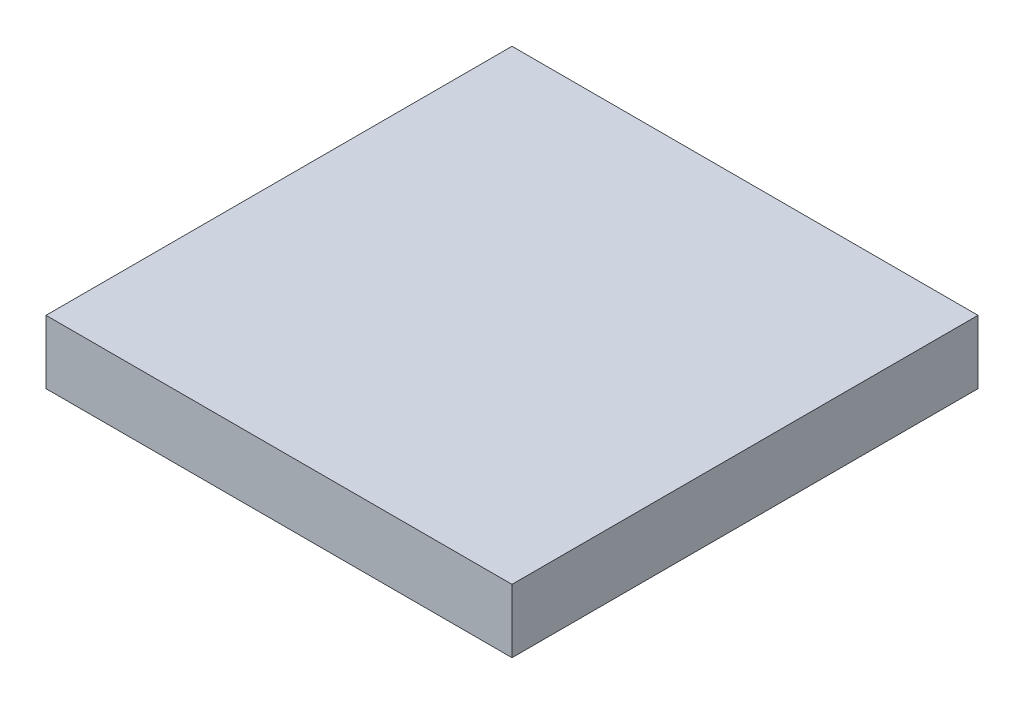
ISO-10303-21;
HEADER;
FILE_DESCRIPTION(('STEP AP214'),'2;1');
FILE_NAME('part.step','',(''),(''),'','','');
FILE_SCHEMA(('AUTOMOTIVE_DESIGN { 1 0 10303 214 1 1 1 1 }'));
ENDSEC;
DATA;
#1=APPLICATION_CONTEXT('core data for automotive mechanical design processes');
#2=APPLICATION_PROTOCOL_DEFINITION('international standard','automotive_design',2000,#1);
#3=PRODUCT_CONTEXT('',#1,'mechanical');
#4=PRODUCT('Part','Part','',(#3));
#5=PRODUCT_RELATED_PRODUCT_CATEGORY('part','',(#4));
#6=PRODUCT_DEFINITION_FORMATION('','',#4);
#7=PRODUCT_DEFINITION_CONTEXT('part definition',#1,'design');
#8=PRODUCT_DEFINITION('design','',#6,#7);
#9=PRODUCT_DEFINITION_SHAPE('','',#8);
#10=(LENGTH_UNIT() NAMED_UNIT(*) SI_UNIT(.MILLI.,.METRE.));
#11=(NAMED_UNIT(*) PLANE_ANGLE_UNIT() SI_UNIT($,.RADIAN.));
#12=(NAMED_UNIT(*) SI_UNIT($,.STERADIAN.) SOLID_ANGLE_UNIT());
#13=UNCERTAINTY_MEASURE_WITH_UNIT(LENGTH_MEASURE(1.E-05),#10,'distance_accuracy_value','');
#14=(GEOMETRIC_REPRESENTATION_CONTEXT(3) GLOBAL_UNCERTAINTY_ASSIGNED_CONTEXT((#13)) GLOBAL_UNIT_ASSIGNED_CONTEXT((#10,
#11,#12)) REPRESENTATION_CONTEXT('',''));
#15=CARTESIAN_POINT('',(0.,0.,0.));
#16=DIRECTION('',(0.,0.,1.));
#17=DIRECTION('',(1.,0.,0.));
#18=AXIS2_PLACEMENT_3D('',#15,#16,#17);
#19=CARTESIAN_POINT('',(0.,3.,0.));
#20=DIRECTION('',(1.,0.,0.));
#21=DIRECTION('',(0.,0.,-1.));
#22=AXIS2_PLACEMENT_3D('',#19,#20,#21);
#23=PLANE('',#22);
#24=DIRECTION('',(0.,0.,1.));
#25=VECTOR('',#24,1.);
#26=CARTESIAN_POINT('',(0.,0.,0.));
#27=LINE('',#26,#25);
#28=CARTESIAN_POINT('',(0.,0.,-22.));
#29=VERTEX_POINT('',#28);
#30=CARTESIAN_POINT('',(0.,0.,0.));
#31=VERTEX_POINT('',#30);
#32=EDGE_CURVE('E110',#29,#31,#27,.T.);
#33=ORIENTED_EDGE('',*,*,#32,.T.);
#34=DIRECTION('',(0.,-1.,0.));
#35=VECTOR('',#34,1.);
#36=CARTESIAN_POINT('',(0.,3.,0.));
#37=LINE('',#36,#35);
#38=CARTESIAN_POINT('',(0.,3.,0.));
#39=VERTEX_POINT('',#38);
#40=EDGE_CURVE('E11',#39,#31,#37,.T.);
#41=ORIENTED_EDGE('',*,*,#40,.F.);
#42=DIRECTION('',(0.,0.,1.));
#43=VECTOR('',#42,1.);
#44=CARTESIAN_POINT('',(0.,3.,0.));
#45=LINE('',#44,#43);
#46=CARTESIAN_POINT('',(0.,3.,-22.));
#47=VERTEX_POINT('',#46);
#48=EDGE_CURVE('E94',#47,#39,#45,.T.);
#49=ORIENTED_EDGE('',*,*,#48,.F.);
#50=DIRECTION('',(0.,-1.,0.));
#51=VECTOR('',#50,1.);
#52=CARTESIAN_POINT('',(0.,3.,-22.));
#53=LINE('',#52,#51);
#54=EDGE_CURVE('E106',#47,#29,#53,.T.);
#55=ORIENTED_EDGE('',*,*,#54,.T.);
#56=EDGE_LOOP('',(#33,#41,#49,#55));
#57=FACE_BOUND('',#56,.T.);
#58=ADVANCED_FACE('F42',(#57),#23,.F.);
#59=CARTESIAN_POINT('',(0.,3.,0.));
#60=DIRECTION('',(0.,0.,-1.));
#61=DIRECTION('',(-1.,0.,0.));
#62=AXIS2_PLACEMENT_3D('',#59,#60,#61);
#63=PLANE('',#62);
#64=DIRECTION('',(1.,0.,0.));
#65=VECTOR('',#64,1.);
#66=CARTESIAN_POINT('',(0.,0.,0.));
#67=LINE('',#66,#65);
#68=CARTESIAN_POINT('',(22.,0.,0.));
#69=VERTEX_POINT('',#68);
#70=EDGE_CURVE('E99',#31,#69,#67,.T.);
#71=ORIENTED_EDGE('',*,*,#70,.T.);
#72=DIRECTION('',(0.,-1.,0.));
#73=VECTOR('',#72,1.);
#74=CARTESIAN_POINT('',(22.,3.,0.));
#75=LINE('',#74,#73);
#76=CARTESIAN_POINT('',(22.,3.,0.));
#77=VERTEX_POINT('',#76);
#78=EDGE_CURVE('E51',#77,#69,#75,.T.);
#79=ORIENTED_EDGE('',*,*,#78,.F.);
#80=DIRECTION('',(1.,0.,0.));
#81=VECTOR('',#80,1.);
#82=CARTESIAN_POINT('',(0.,3.,0.));
#83=LINE('',#82,#81);
#84=EDGE_CURVE('E89',#39,#77,#83,.T.);
#85=ORIENTED_EDGE('',*,*,#84,.F.);
#86=ORIENTED_EDGE('',*,*,#40,.T.);
#87=EDGE_LOOP('',(#71,#79,#85,#86));
#88=FACE_BOUND('',#87,.T.);
#89=ADVANCED_FACE('F98',(#88),#63,.F.);
#90=CARTESIAN_POINT('',(22.,3.,0.));
#91=DIRECTION('',(-1.,0.,0.));
#92=DIRECTION('',(0.,0.,1.));
#93=AXIS2_PLACEMENT_3D('',#90,#91,#92);
#94=PLANE('',#93);
#95=DIRECTION('',(0.,0.,-1.));
#96=VECTOR('',#95,1.);
#97=CARTESIAN_POINT('',(22.,0.,0.));
#98=LINE('',#97,#96);
#99=CARTESIAN_POINT('',(22.,0.,-22.));
#100=VERTEX_POINT('',#99);
#101=EDGE_CURVE('E76',#69,#100,#98,.T.);
#102=ORIENTED_EDGE('',*,*,#101,.T.);
#103=DIRECTION('',(0.,-1.,0.));
#104=VECTOR('',#103,1.);
#105=CARTESIAN_POINT('',(22.,3.,-22.));
#106=LINE('',#105,#104);
#107=CARTESIAN_POINT('',(22.,3.,-22.));
#108=VERTEX_POINT('',#107);
#109=EDGE_CURVE('E101',#108,#100,#106,.T.);
#110=ORIENTED_EDGE('',*,*,#109,.F.);
#111=DIRECTION('',(0.,0.,-1.));
#112=VECTOR('',#111,1.);
#113=CARTESIAN_POINT('',(22.,3.,0.));
#114=LINE('',#113,#112);
#115=EDGE_CURVE('E92',#77,#108,#114,.T.);
#116=ORIENTED_EDGE('',*,*,#115,.F.);
#117=ORIENTED_EDGE('',*,*,#78,.T.);
#118=EDGE_LOOP('',(#102,#110,#116,#117));
#119=FACE_BOUND('',#118,.T.);
#120=ADVANCED_FACE('F102',(#119),#94,.F.);
#121=CARTESIAN_POINT('',(0.,3.,-22.));
#122=DIRECTION('',(0.,0.,1.));
#123=DIRECTION('',(1.,0.,0.));
#124=AXIS2_PLACEMENT_3D('',#121,#122,#123);
#125=PLANE('',#124);
#126=DIRECTION('',(-1.,0.,0.));
#127=VECTOR('',#126,1.);
#128=CARTESIAN_POINT('',(0.,0.,-22.));
#129=LINE('',#128,#127);
#130=EDGE_CURVE('E82',#100,#29,#129,.T.);
#131=ORIENTED_EDGE('',*,*,#130,.T.);
#132=ORIENTED_EDGE('',*,*,#54,.F.);
#133=DIRECTION('',(-1.,0.,0.));
#134=VECTOR('',#133,1.);
#135=CARTESIAN_POINT('',(0.,3.,-22.));
#136=LINE('',#135,#134);
#137=EDGE_CURVE('E59',#108,#47,#136,.T.);
#138=ORIENTED_EDGE('',*,*,#137,.F.);
#139=ORIENTED_EDGE('',*,*,#109,.T.);
#140=EDGE_LOOP('',(#131,#132,#138,#139));
#141=FACE_BOUND('',#140,.T.);
#142=ADVANCED_FACE('F123',(#141),#125,.F.);
#143=CARTESIAN_POINT('',(0.,3.,0.));
#144=DIRECTION('',(0.,-1.,0.));
#145=DIRECTION('',(0.,0.,-1.));
#146=AXIS2_PLACEMENT_3D('',#143,#144,#145);
#147=PLANE('',#146);
#148=ORIENTED_EDGE('',*,*,#48,.T.);
#149=ORIENTED_EDGE('',*,*,#84,.T.);
#150=ORIENTED_EDGE('',*,*,#115,.T.);
#151=ORIENTED_EDGE('',*,*,#137,.T.);
#152=EDGE_LOOP('',(#148,#149,#150,#151));
#153=FACE_BOUND('',#152,.T.);
#154=ADVANCED_FACE('F90',(#153),#147,.F.);
#155=CARTESIAN_POINT('',(0.,0.,0.));
#156=DIRECTION('',(0.,-1.,0.));
#157=DIRECTION('',(0.,0.,-1.));
#158=AXIS2_PLACEMENT_3D('',#155,#156,#157);
#159=PLANE('',#158);
#160=ORIENTED_EDGE('',*,*,#32,.F.);
#161=ORIENTED_EDGE('',*,*,#130,.F.);
#162=ORIENTED_EDGE('',*,*,#101,.F.);
#163=ORIENTED_EDGE('',*,*,#70,.F.);
#164=EDGE_LOOP('',(#160,#161,#162,#163));
#165=FACE_BOUND('',#164,.T.);
#166=ADVANCED_FACE('F126',(#165),#159,.T.);
#167=CLOSED_SHELL('',(#58,#89,#120,#142,#154,#166));
#168=MANIFOLD_SOLID_BREP('B2',#167);
#169=ADVANCED_BREP_SHAPE_REPRESENTATION('',(#18,#168),#14);
#170=SHAPE_DEFINITION_REPRESENTATION(#9,#169);
ENDSEC;
END-ISO-10303-21;
